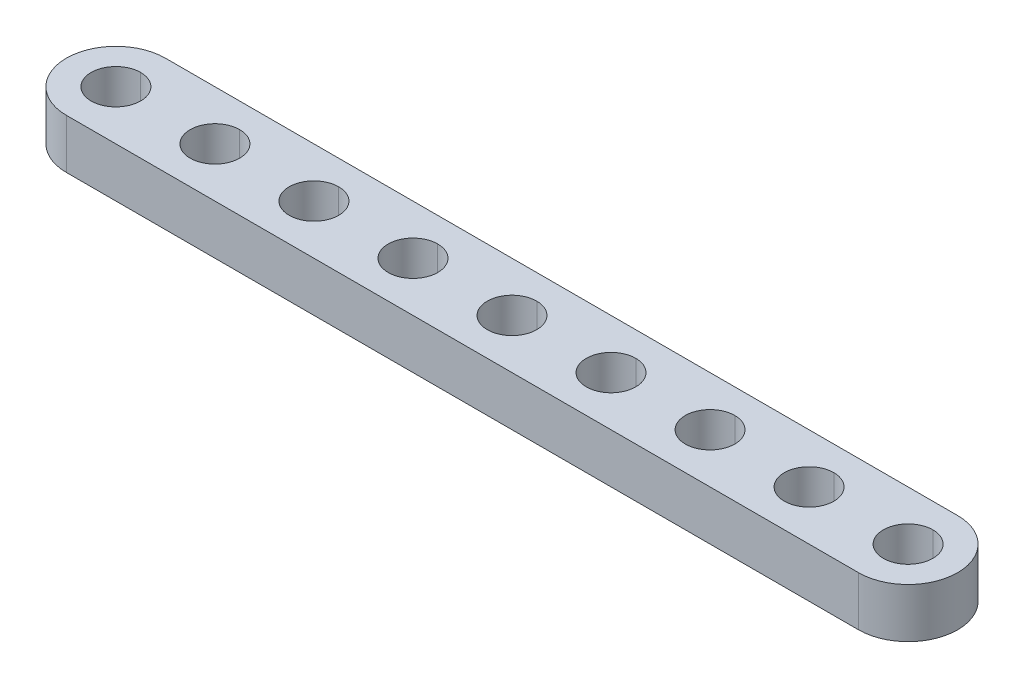
ISO-10303-21;
HEADER;
FILE_DESCRIPTION(('STEP AP214'),'2;1');
FILE_NAME('part.step','',(''),(''),'','','');
FILE_SCHEMA(('AUTOMOTIVE_DESIGN { 1 0 10303 214 1 1 1 1 }'));
ENDSEC;
DATA;
#1=APPLICATION_CONTEXT('core data for automotive mechanical design processes');
#2=APPLICATION_PROTOCOL_DEFINITION('international standard','automotive_design',2000,#1);
#3=PRODUCT_CONTEXT('',#1,'mechanical');
#4=PRODUCT('Part','Part','',(#3));
#5=PRODUCT_RELATED_PRODUCT_CATEGORY('part','',(#4));
#6=PRODUCT_DEFINITION_FORMATION('','',#4);
#7=PRODUCT_DEFINITION_CONTEXT('part definition',#1,'design');
#8=PRODUCT_DEFINITION('design','',#6,#7);
#9=PRODUCT_DEFINITION_SHAPE('','',#8);
#10=(LENGTH_UNIT() NAMED_UNIT(*) SI_UNIT(.MILLI.,.METRE.));
#11=(NAMED_UNIT(*) PLANE_ANGLE_UNIT() SI_UNIT($,.RADIAN.));
#12=(NAMED_UNIT(*) SI_UNIT($,.STERADIAN.) SOLID_ANGLE_UNIT());
#13=UNCERTAINTY_MEASURE_WITH_UNIT(LENGTH_MEASURE(1.E-05),#10,'distance_accuracy_value','');
#14=(GEOMETRIC_REPRESENTATION_CONTEXT(3) GLOBAL_UNCERTAINTY_ASSIGNED_CONTEXT((#13)) GLOBAL_UNIT_ASSIGNED_CONTEXT((#10,
#11,#12)) REPRESENTATION_CONTEXT('',''));
#15=CARTESIAN_POINT('',(0.,0.,0.));
#16=DIRECTION('',(0.,0.,1.));
#17=DIRECTION('',(1.,0.,0.));
#18=AXIS2_PLACEMENT_3D('',#15,#16,#17);
#19=CARTESIAN_POINT('',(32.,4.,0.));
#20=DIRECTION('',(0.,1.,0.));
#21=DIRECTION('',(0.,0.,1.));
#22=AXIS2_PLACEMENT_3D('',#19,#20,#21);
#23=CYLINDRICAL_SURFACE('',#22,2.);
#24=DIRECTION('',(0.,1.,0.));
#25=VECTOR('',#24,1.);
#26=CARTESIAN_POINT('',(32.,4.,-2.));
#27=LINE('',#26,#25);
#28=CARTESIAN_POINT('',(32.,0.,-2.));
#29=VERTEX_POINT('',#28);
#30=CARTESIAN_POINT('',(32.,4.,-2.));
#31=VERTEX_POINT('',#30);
#32=EDGE_CURVE('E353',#29,#31,#27,.T.);
#33=ORIENTED_EDGE('',*,*,#32,.F.);
#34=CARTESIAN_POINT('',(32.,0.,0.));
#35=DIRECTION('',(0.,1.,0.));
#36=DIRECTION('',(0.,0.,1.));
#37=AXIS2_PLACEMENT_3D('',#34,#35,#36);
#38=CIRCLE('',#37,2.);
#39=CARTESIAN_POINT('',(32.,0.,2.));
#40=VERTEX_POINT('',#39);
#41=EDGE_CURVE('E298',#40,#29,#38,.T.);
#42=ORIENTED_EDGE('',*,*,#41,.F.);
#43=DIRECTION('',(0.,1.,0.));
#44=VECTOR('',#43,1.);
#45=CARTESIAN_POINT('',(32.,4.,2.));
#46=LINE('',#45,#44);
#47=CARTESIAN_POINT('',(32.,4.,2.));
#48=VERTEX_POINT('',#47);
#49=EDGE_CURVE('E406',#40,#48,#46,.T.);
#50=ORIENTED_EDGE('',*,*,#49,.T.);
#51=CARTESIAN_POINT('',(32.,4.,0.));
#52=DIRECTION('',(0.,1.,0.));
#53=DIRECTION('',(0.,0.,1.));
#54=AXIS2_PLACEMENT_3D('',#51,#52,#53);
#55=CIRCLE('',#54,2.);
#56=EDGE_CURVE('E276',#48,#31,#55,.T.);
#57=ORIENTED_EDGE('',*,*,#56,.T.);
#58=EDGE_LOOP('',(#33,#42,#50,#57));
#59=FACE_BOUND('',#58,.T.);
#60=ADVANCED_FACE('F17',(#59),#23,.F.);
#61=CARTESIAN_POINT('',(24.,4.,0.));
#62=DIRECTION('',(0.,1.,0.));
#63=DIRECTION('',(0.,0.,1.));
#64=AXIS2_PLACEMENT_3D('',#61,#62,#63);
#65=CYLINDRICAL_SURFACE('',#64,2.);
#66=DIRECTION('',(0.,1.,0.));
#67=VECTOR('',#66,1.);
#68=CARTESIAN_POINT('',(24.,4.,-2.));
#69=LINE('',#68,#67);
#70=CARTESIAN_POINT('',(24.,0.,-2.));
#71=VERTEX_POINT('',#70);
#72=CARTESIAN_POINT('',(24.,4.,-2.));
#73=VERTEX_POINT('',#72);
#74=EDGE_CURVE('E503',#71,#73,#69,.T.);
#75=ORIENTED_EDGE('',*,*,#74,.F.);
#76=CARTESIAN_POINT('',(24.,0.,0.));
#77=DIRECTION('',(0.,1.,0.));
#78=DIRECTION('',(0.,0.,1.));
#79=AXIS2_PLACEMENT_3D('',#76,#77,#78);
#80=CIRCLE('',#79,2.);
#81=CARTESIAN_POINT('',(24.,0.,2.));
#82=VERTEX_POINT('',#81);
#83=EDGE_CURVE('E301',#82,#71,#80,.T.);
#84=ORIENTED_EDGE('',*,*,#83,.F.);
#85=DIRECTION('',(0.,1.,0.));
#86=VECTOR('',#85,1.);
#87=CARTESIAN_POINT('',(24.,4.,2.));
#88=LINE('',#87,#86);
#89=CARTESIAN_POINT('',(24.,4.,2.));
#90=VERTEX_POINT('',#89);
#91=EDGE_CURVE('E359',#82,#90,#88,.T.);
#92=ORIENTED_EDGE('',*,*,#91,.T.);
#93=CARTESIAN_POINT('',(24.,4.,0.));
#94=DIRECTION('',(0.,1.,0.));
#95=DIRECTION('',(0.,0.,1.));
#96=AXIS2_PLACEMENT_3D('',#93,#94,#95);
#97=CIRCLE('',#96,2.);
#98=EDGE_CURVE('E272',#90,#73,#97,.T.);
#99=ORIENTED_EDGE('',*,*,#98,.T.);
#100=EDGE_LOOP('',(#75,#84,#92,#99));
#101=FACE_BOUND('',#100,.T.);
#102=ADVANCED_FACE('F431',(#101),#65,.F.);
#103=CARTESIAN_POINT('',(16.,4.,0.));
#104=DIRECTION('',(0.,1.,0.));
#105=DIRECTION('',(0.,0.,1.));
#106=AXIS2_PLACEMENT_3D('',#103,#104,#105);
#107=CYLINDRICAL_SURFACE('',#106,2.);
#108=DIRECTION('',(0.,1.,0.));
#109=VECTOR('',#108,1.);
#110=CARTESIAN_POINT('',(16.,4.,-2.));
#111=LINE('',#110,#109);
#112=CARTESIAN_POINT('',(16.,0.,-2.));
#113=VERTEX_POINT('',#112);
#114=CARTESIAN_POINT('',(16.,4.,-2.));
#115=VERTEX_POINT('',#114);
#116=EDGE_CURVE('E372',#113,#115,#111,.T.);
#117=ORIENTED_EDGE('',*,*,#116,.F.);
#118=CARTESIAN_POINT('',(16.,0.,0.));
#119=DIRECTION('',(0.,1.,0.));
#120=DIRECTION('',(0.,0.,1.));
#121=AXIS2_PLACEMENT_3D('',#118,#119,#120);
#122=CIRCLE('',#121,2.);
#123=CARTESIAN_POINT('',(16.,0.,2.));
#124=VERTEX_POINT('',#123);
#125=EDGE_CURVE('E312',#124,#113,#122,.T.);
#126=ORIENTED_EDGE('',*,*,#125,.F.);
#127=DIRECTION('',(0.,1.,0.));
#128=VECTOR('',#127,1.);
#129=CARTESIAN_POINT('',(16.,4.,2.));
#130=LINE('',#129,#128);
#131=CARTESIAN_POINT('',(16.,4.,2.));
#132=VERTEX_POINT('',#131);
#133=EDGE_CURVE('E334',#124,#132,#130,.T.);
#134=ORIENTED_EDGE('',*,*,#133,.T.);
#135=CARTESIAN_POINT('',(16.,4.,0.));
#136=DIRECTION('',(0.,1.,0.));
#137=DIRECTION('',(0.,0.,1.));
#138=AXIS2_PLACEMENT_3D('',#135,#136,#137);
#139=CIRCLE('',#138,2.);
#140=EDGE_CURVE('E275',#132,#115,#139,.T.);
#141=ORIENTED_EDGE('',*,*,#140,.T.);
#142=EDGE_LOOP('',(#117,#126,#134,#141));
#143=FACE_BOUND('',#142,.T.);
#144=ADVANCED_FACE('F437',(#143),#107,.F.);
#145=CARTESIAN_POINT('',(8.,4.,0.));
#146=DIRECTION('',(0.,1.,0.));
#147=DIRECTION('',(0.,0.,1.));
#148=AXIS2_PLACEMENT_3D('',#145,#146,#147);
#149=CYLINDRICAL_SURFACE('',#148,2.);
#150=DIRECTION('',(0.,1.,0.));
#151=VECTOR('',#150,1.);
#152=CARTESIAN_POINT('',(8.,4.,-2.));
#153=LINE('',#152,#151);
#154=CARTESIAN_POINT('',(8.,0.,-2.));
#155=VERTEX_POINT('',#154);
#156=CARTESIAN_POINT('',(8.,4.,-2.));
#157=VERTEX_POINT('',#156);
#158=EDGE_CURVE('E319',#155,#157,#153,.T.);
#159=ORIENTED_EDGE('',*,*,#158,.F.);
#160=CARTESIAN_POINT('',(8.,0.,0.));
#161=DIRECTION('',(0.,1.,0.));
#162=DIRECTION('',(0.,0.,1.));
#163=AXIS2_PLACEMENT_3D('',#160,#161,#162);
#164=CIRCLE('',#163,2.);
#165=CARTESIAN_POINT('',(8.,0.,2.));
#166=VERTEX_POINT('',#165);
#167=EDGE_CURVE('E227',#166,#155,#164,.T.);
#168=ORIENTED_EDGE('',*,*,#167,.F.);
#169=DIRECTION('',(0.,1.,0.));
#170=VECTOR('',#169,1.);
#171=CARTESIAN_POINT('',(8.,4.,2.));
#172=LINE('',#171,#170);
#173=CARTESIAN_POINT('',(8.,4.,2.));
#174=VERTEX_POINT('',#173);
#175=EDGE_CURVE('E242',#166,#174,#172,.T.);
#176=ORIENTED_EDGE('',*,*,#175,.T.);
#177=CARTESIAN_POINT('',(8.,4.,0.));
#178=DIRECTION('',(0.,1.,0.));
#179=DIRECTION('',(0.,0.,1.));
#180=AXIS2_PLACEMENT_3D('',#177,#178,#179);
#181=CIRCLE('',#180,2.);
#182=EDGE_CURVE('E286',#174,#157,#181,.T.);
#183=ORIENTED_EDGE('',*,*,#182,.T.);
#184=EDGE_LOOP('',(#159,#168,#176,#183));
#185=FACE_BOUND('',#184,.T.);
#186=ADVANCED_FACE('F576',(#185),#149,.F.);
#187=CARTESIAN_POINT('',(0.,4.,0.));
#188=DIRECTION('',(0.,1.,0.));
#189=DIRECTION('',(0.,0.,1.));
#190=AXIS2_PLACEMENT_3D('',#187,#188,#189);
#191=CYLINDRICAL_SURFACE('',#190,2.);
#192=DIRECTION('',(0.,1.,0.));
#193=VECTOR('',#192,1.);
#194=CARTESIAN_POINT('',(0.,4.,-2.));
#195=LINE('',#194,#193);
#196=CARTESIAN_POINT('',(0.,0.,-2.));
#197=VERTEX_POINT('',#196);
#198=CARTESIAN_POINT('',(0.,4.,-2.));
#199=VERTEX_POINT('',#198);
#200=EDGE_CURVE('E230',#197,#199,#195,.T.);
#201=ORIENTED_EDGE('',*,*,#200,.F.);
#202=CARTESIAN_POINT('',(0.,0.,0.));
#203=DIRECTION('',(0.,1.,0.));
#204=DIRECTION('',(0.,0.,1.));
#205=AXIS2_PLACEMENT_3D('',#202,#203,#204);
#206=CIRCLE('',#205,2.);
#207=CARTESIAN_POINT('',(0.,0.,2.));
#208=VERTEX_POINT('',#207);
#209=EDGE_CURVE('E216',#208,#197,#206,.T.);
#210=ORIENTED_EDGE('',*,*,#209,.F.);
#211=DIRECTION('',(0.,1.,0.));
#212=VECTOR('',#211,1.);
#213=CARTESIAN_POINT('',(0.,4.,2.));
#214=LINE('',#213,#212);
#215=CARTESIAN_POINT('',(0.,4.,2.));
#216=VERTEX_POINT('',#215);
#217=EDGE_CURVE('E240',#208,#216,#214,.T.);
#218=ORIENTED_EDGE('',*,*,#217,.T.);
#219=CARTESIAN_POINT('',(0.,4.,0.));
#220=DIRECTION('',(0.,1.,0.));
#221=DIRECTION('',(0.,0.,1.));
#222=AXIS2_PLACEMENT_3D('',#219,#220,#221);
#223=CIRCLE('',#222,2.);
#224=EDGE_CURVE('E232',#216,#199,#223,.T.);
#225=ORIENTED_EDGE('',*,*,#224,.T.);
#226=EDGE_LOOP('',(#201,#210,#218,#225));
#227=FACE_BOUND('',#226,.T.);
#228=ADVANCED_FACE('F231',(#227),#191,.F.);
#229=CARTESIAN_POINT('',(-8.,4.,0.));
#230=DIRECTION('',(0.,1.,0.));
#231=DIRECTION('',(0.,0.,1.));
#232=AXIS2_PLACEMENT_3D('',#229,#230,#231);
#233=CYLINDRICAL_SURFACE('',#232,2.);
#234=DIRECTION('',(0.,1.,0.));
#235=VECTOR('',#234,1.);
#236=CARTESIAN_POINT('',(-8.,4.,-2.));
#237=LINE('',#236,#235);
#238=CARTESIAN_POINT('',(-8.,0.,-2.));
#239=VERTEX_POINT('',#238);
#240=CARTESIAN_POINT('',(-8.,4.,-2.));
#241=VERTEX_POINT('',#240);
#242=EDGE_CURVE('E287',#239,#241,#237,.T.);
#243=ORIENTED_EDGE('',*,*,#242,.F.);
#244=CARTESIAN_POINT('',(-8.,0.,0.));
#245=DIRECTION('',(0.,1.,0.));
#246=DIRECTION('',(0.,0.,1.));
#247=AXIS2_PLACEMENT_3D('',#244,#245,#246);
#248=CIRCLE('',#247,2.);
#249=CARTESIAN_POINT('',(-8.,0.,2.));
#250=VERTEX_POINT('',#249);
#251=EDGE_CURVE('E226',#250,#239,#248,.T.);
#252=ORIENTED_EDGE('',*,*,#251,.F.);
#253=DIRECTION('',(0.,1.,0.));
#254=VECTOR('',#253,1.);
#255=CARTESIAN_POINT('',(-8.,4.,2.));
#256=LINE('',#255,#254);
#257=CARTESIAN_POINT('',(-8.,4.,2.));
#258=VERTEX_POINT('',#257);
#259=EDGE_CURVE('E311',#250,#258,#256,.T.);
#260=ORIENTED_EDGE('',*,*,#259,.T.);
#261=CARTESIAN_POINT('',(-8.,4.,0.));
#262=DIRECTION('',(0.,1.,0.));
#263=DIRECTION('',(0.,0.,1.));
#264=AXIS2_PLACEMENT_3D('',#261,#262,#263);
#265=CIRCLE('',#264,2.);
#266=EDGE_CURVE('E305',#258,#241,#265,.T.);
#267=ORIENTED_EDGE('',*,*,#266,.T.);
#268=EDGE_LOOP('',(#243,#252,#260,#267));
#269=FACE_BOUND('',#268,.T.);
#270=ADVANCED_FACE('F581',(#269),#233,.F.);
#271=CARTESIAN_POINT('',(-16.,4.,0.));
#272=DIRECTION('',(0.,1.,0.));
#273=DIRECTION('',(0.,0.,1.));
#274=AXIS2_PLACEMENT_3D('',#271,#272,#273);
#275=CYLINDRICAL_SURFACE('',#274,2.);
#276=DIRECTION('',(0.,1.,0.));
#277=VECTOR('',#276,1.);
#278=CARTESIAN_POINT('',(-16.,4.,-2.));
#279=LINE('',#278,#277);
#280=CARTESIAN_POINT('',(-16.,0.,-2.));
#281=VERTEX_POINT('',#280);
#282=CARTESIAN_POINT('',(-16.,4.,-2.));
#283=VERTEX_POINT('',#282);
#284=EDGE_CURVE('E310',#281,#283,#279,.T.);
#285=ORIENTED_EDGE('',*,*,#284,.F.);
#286=CARTESIAN_POINT('',(-16.,0.,0.));
#287=DIRECTION('',(0.,1.,0.));
#288=DIRECTION('',(0.,0.,1.));
#289=AXIS2_PLACEMENT_3D('',#286,#287,#288);
#290=CIRCLE('',#289,2.);
#291=CARTESIAN_POINT('',(-16.,0.,2.));
#292=VERTEX_POINT('',#291);
#293=EDGE_CURVE('E381',#292,#281,#290,.T.);
#294=ORIENTED_EDGE('',*,*,#293,.F.);
#295=DIRECTION('',(0.,1.,0.));
#296=VECTOR('',#295,1.);
#297=CARTESIAN_POINT('',(-16.,4.,2.));
#298=LINE('',#297,#296);
#299=CARTESIAN_POINT('',(-16.,4.,2.));
#300=VERTEX_POINT('',#299);
#301=EDGE_CURVE('E282',#292,#300,#298,.T.);
#302=ORIENTED_EDGE('',*,*,#301,.T.);
#303=CARTESIAN_POINT('',(-16.,4.,0.));
#304=DIRECTION('',(0.,1.,0.));
#305=DIRECTION('',(0.,0.,1.));
#306=AXIS2_PLACEMENT_3D('',#303,#304,#305);
#307=CIRCLE('',#306,2.);
#308=EDGE_CURVE('E330',#300,#283,#307,.T.);
#309=ORIENTED_EDGE('',*,*,#308,.T.);
#310=EDGE_LOOP('',(#285,#294,#302,#309));
#311=FACE_BOUND('',#310,.T.);
#312=ADVANCED_FACE('F446',(#311),#275,.F.);
#313=CARTESIAN_POINT('',(-24.,4.,0.));
#314=DIRECTION('',(0.,1.,0.));
#315=DIRECTION('',(0.,0.,1.));
#316=AXIS2_PLACEMENT_3D('',#313,#314,#315);
#317=CYLINDRICAL_SURFACE('',#316,2.);
#318=DIRECTION('',(0.,1.,0.));
#319=VECTOR('',#318,1.);
#320=CARTESIAN_POINT('',(-24.,4.,-2.));
#321=LINE('',#320,#319);
#322=CARTESIAN_POINT('',(-24.,0.,-2.));
#323=VERTEX_POINT('',#322);
#324=CARTESIAN_POINT('',(-24.,4.,-2.));
#325=VERTEX_POINT('',#324);
#326=EDGE_CURVE('E281',#323,#325,#321,.T.);
#327=ORIENTED_EDGE('',*,*,#326,.F.);
#328=CARTESIAN_POINT('',(-24.,0.,0.));
#329=DIRECTION('',(0.,1.,0.));
#330=DIRECTION('',(0.,0.,1.));
#331=AXIS2_PLACEMENT_3D('',#328,#329,#330);
#332=CIRCLE('',#331,2.);
#333=CARTESIAN_POINT('',(-24.,0.,2.));
#334=VERTEX_POINT('',#333);
#335=EDGE_CURVE('E28',#334,#323,#332,.T.);
#336=ORIENTED_EDGE('',*,*,#335,.F.);
#337=DIRECTION('',(0.,1.,0.));
#338=VECTOR('',#337,1.);
#339=CARTESIAN_POINT('',(-24.,4.,2.));
#340=LINE('',#339,#338);
#341=CARTESIAN_POINT('',(-24.,4.,2.));
#342=VERTEX_POINT('',#341);
#343=EDGE_CURVE('E352',#334,#342,#340,.T.);
#344=ORIENTED_EDGE('',*,*,#343,.T.);
#345=CARTESIAN_POINT('',(-24.,4.,0.));
#346=DIRECTION('',(0.,1.,0.));
#347=DIRECTION('',(0.,0.,1.));
#348=AXIS2_PLACEMENT_3D('',#345,#346,#347);
#349=CIRCLE('',#348,2.);
#350=EDGE_CURVE('E327',#342,#325,#349,.T.);
#351=ORIENTED_EDGE('',*,*,#350,.T.);
#352=EDGE_LOOP('',(#327,#336,#344,#351));
#353=FACE_BOUND('',#352,.T.);
#354=ADVANCED_FACE('F443',(#353),#317,.F.);
#355=CARTESIAN_POINT('',(-32.,4.,0.));
#356=DIRECTION('',(0.,1.,0.));
#357=DIRECTION('',(0.,0.,1.));
#358=AXIS2_PLACEMENT_3D('',#355,#356,#357);
#359=CYLINDRICAL_SURFACE('',#358,2.);
#360=DIRECTION('',(0.,1.,0.));
#361=VECTOR('',#360,1.);
#362=CARTESIAN_POINT('',(-32.,4.,-2.));
#363=LINE('',#362,#361);
#364=CARTESIAN_POINT('',(-32.,0.,-2.));
#365=VERTEX_POINT('',#364);
#366=CARTESIAN_POINT('',(-32.,4.,-2.));
#367=VERTEX_POINT('',#366);
#368=EDGE_CURVE('E271',#365,#367,#363,.T.);
#369=ORIENTED_EDGE('',*,*,#368,.F.);
#370=CARTESIAN_POINT('',(-32.,0.,0.));
#371=DIRECTION('',(0.,1.,0.));
#372=DIRECTION('',(0.,0.,1.));
#373=AXIS2_PLACEMENT_3D('',#370,#371,#372);
#374=CIRCLE('',#373,2.);
#375=CARTESIAN_POINT('',(-32.,0.,2.));
#376=VERTEX_POINT('',#375);
#377=EDGE_CURVE('E11',#376,#365,#374,.T.);
#378=ORIENTED_EDGE('',*,*,#377,.F.);
#379=DIRECTION('',(0.,1.,0.));
#380=VECTOR('',#379,1.);
#381=CARTESIAN_POINT('',(-32.,4.,2.));
#382=LINE('',#381,#380);
#383=CARTESIAN_POINT('',(-32.,4.,2.));
#384=VERTEX_POINT('',#383);
#385=EDGE_CURVE('E21',#376,#384,#382,.T.);
#386=ORIENTED_EDGE('',*,*,#385,.T.);
#387=CARTESIAN_POINT('',(-32.,4.,0.));
#388=DIRECTION('',(0.,1.,0.));
#389=DIRECTION('',(0.,0.,1.));
#390=AXIS2_PLACEMENT_3D('',#387,#388,#389);
#391=CIRCLE('',#390,2.);
#392=EDGE_CURVE('E302',#384,#367,#391,.T.);
#393=ORIENTED_EDGE('',*,*,#392,.T.);
#394=EDGE_LOOP('',(#369,#378,#386,#393));
#395=FACE_BOUND('',#394,.T.);
#396=ADVANCED_FACE('F19',(#395),#359,.F.);
#397=CARTESIAN_POINT('',(-32.,0.,0.));
#398=DIRECTION('',(0.,1.,0.));
#399=DIRECTION('',(1.,0.,0.));
#400=AXIS2_PLACEMENT_3D('',#397,#398,#399);
#401=PLANE('',#400);
#402=ORIENTED_EDGE('',*,*,#377,.T.);
#403=CARTESIAN_POINT('',(-32.,0.,0.));
#404=DIRECTION('',(0.,1.,0.));
#405=DIRECTION('',(0.,0.,1.));
#406=AXIS2_PLACEMENT_3D('',#403,#404,#405);
#407=CIRCLE('',#406,2.);
#408=EDGE_CURVE('E348',#365,#376,#407,.T.);
#409=ORIENTED_EDGE('',*,*,#408,.T.);
#410=EDGE_LOOP('',(#402,#409));
#411=FACE_BOUND('',#410,.T.);
#412=ORIENTED_EDGE('',*,*,#335,.T.);
#413=CARTESIAN_POINT('',(-24.,0.,0.));
#414=DIRECTION('',(0.,1.,0.));
#415=DIRECTION('',(0.,0.,1.));
#416=AXIS2_PLACEMENT_3D('',#413,#414,#415);
#417=CIRCLE('',#416,2.);
#418=EDGE_CURVE('E277',#323,#334,#417,.T.);
#419=ORIENTED_EDGE('',*,*,#418,.T.);
#420=EDGE_LOOP('',(#412,#419));
#421=FACE_BOUND('',#420,.T.);
#422=ORIENTED_EDGE('',*,*,#293,.T.);
#423=CARTESIAN_POINT('',(-16.,0.,0.));
#424=DIRECTION('',(0.,1.,0.));
#425=DIRECTION('',(0.,0.,1.));
#426=AXIS2_PLACEMENT_3D('',#423,#424,#425);
#427=CIRCLE('',#426,2.);
#428=EDGE_CURVE('E306',#281,#292,#427,.T.);
#429=ORIENTED_EDGE('',*,*,#428,.T.);
#430=EDGE_LOOP('',(#422,#429));
#431=FACE_BOUND('',#430,.T.);
#432=ORIENTED_EDGE('',*,*,#251,.T.);
#433=CARTESIAN_POINT('',(-8.,0.,0.));
#434=DIRECTION('',(0.,1.,0.));
#435=DIRECTION('',(0.,0.,1.));
#436=AXIS2_PLACEMENT_3D('',#433,#434,#435);
#437=CIRCLE('',#436,2.);
#438=EDGE_CURVE('E292',#239,#250,#437,.T.);
#439=ORIENTED_EDGE('',*,*,#438,.T.);
#440=EDGE_LOOP('',(#432,#439));
#441=FACE_BOUND('',#440,.T.);
#442=ORIENTED_EDGE('',*,*,#209,.T.);
#443=CARTESIAN_POINT('',(0.,0.,0.));
#444=DIRECTION('',(0.,1.,0.));
#445=DIRECTION('',(0.,0.,1.));
#446=AXIS2_PLACEMENT_3D('',#443,#444,#445);
#447=CIRCLE('',#446,2.);
#448=EDGE_CURVE('E221',#197,#208,#447,.T.);
#449=ORIENTED_EDGE('',*,*,#448,.T.);
#450=EDGE_LOOP('',(#442,#449));
#451=FACE_BOUND('',#450,.T.);
#452=ORIENTED_EDGE('',*,*,#167,.T.);
#453=CARTESIAN_POINT('',(8.,0.,0.));
#454=DIRECTION('',(0.,1.,0.));
#455=DIRECTION('',(0.,0.,1.));
#456=AXIS2_PLACEMENT_3D('',#453,#454,#455);
#457=CIRCLE('',#456,2.);
#458=EDGE_CURVE('E323',#155,#166,#457,.T.);
#459=ORIENTED_EDGE('',*,*,#458,.T.);
#460=EDGE_LOOP('',(#452,#459));
#461=FACE_BOUND('',#460,.T.);
#462=ORIENTED_EDGE('',*,*,#125,.T.);
#463=CARTESIAN_POINT('',(16.,0.,0.));
#464=DIRECTION('',(0.,1.,0.));
#465=DIRECTION('',(0.,0.,1.));
#466=AXIS2_PLACEMENT_3D('',#463,#464,#465);
#467=CIRCLE('',#466,2.);
#468=EDGE_CURVE('E363',#113,#124,#467,.T.);
#469=ORIENTED_EDGE('',*,*,#468,.T.);
#470=EDGE_LOOP('',(#462,#469));
#471=FACE_BOUND('',#470,.T.);
#472=ORIENTED_EDGE('',*,*,#83,.T.);
#473=CARTESIAN_POINT('',(24.,0.,0.));
#474=DIRECTION('',(0.,1.,0.));
#475=DIRECTION('',(0.,0.,1.));
#476=AXIS2_PLACEMENT_3D('',#473,#474,#475);
#477=CIRCLE('',#476,2.);
#478=EDGE_CURVE('E505',#71,#82,#477,.T.);
#479=ORIENTED_EDGE('',*,*,#478,.T.);
#480=EDGE_LOOP('',(#472,#479));
#481=FACE_BOUND('',#480,.T.);
#482=ORIENTED_EDGE('',*,*,#41,.T.);
#483=CARTESIAN_POINT('',(32.,0.,0.));
#484=DIRECTION('',(0.,1.,0.));
#485=DIRECTION('',(0.,0.,1.));
#486=AXIS2_PLACEMENT_3D('',#483,#484,#485);
#487=CIRCLE('',#486,2.);
#488=EDGE_CURVE('E358',#29,#40,#487,.T.);
#489=ORIENTED_EDGE('',*,*,#488,.T.);
#490=EDGE_LOOP('',(#482,#489));
#491=FACE_BOUND('',#490,.T.);
#492=CARTESIAN_POINT('',(-32.,0.,0.));
#493=DIRECTION('',(0.,1.,0.));
#494=DIRECTION('',(0.,0.,1.));
#495=AXIS2_PLACEMENT_3D('',#492,#493,#494);
#496=CIRCLE('',#495,4.);
#497=CARTESIAN_POINT('',(-32.,0.,-4.));
#498=VERTEX_POINT('',#497);
#499=CARTESIAN_POINT('',(-32.,0.,4.));
#500=VERTEX_POINT('',#499);
#501=EDGE_CURVE('E368',#498,#500,#496,.T.);
#502=ORIENTED_EDGE('',*,*,#501,.F.);
#503=DIRECTION('',(-1.,0.,0.));
#504=VECTOR('',#503,1.);
#505=CARTESIAN_POINT('',(-32.,0.,-4.));
#506=LINE('',#505,#504);
#507=CARTESIAN_POINT('',(32.,0.,-4.));
#508=VERTEX_POINT('',#507);
#509=EDGE_CURVE('E147',#508,#498,#506,.T.);
#510=ORIENTED_EDGE('',*,*,#509,.F.);
#511=CARTESIAN_POINT('',(32.,0.,0.));
#512=DIRECTION('',(0.,1.,0.));
#513=DIRECTION('',(0.,0.,1.));
#514=AXIS2_PLACEMENT_3D('',#511,#512,#513);
#515=CIRCLE('',#514,4.);
#516=CARTESIAN_POINT('',(32.,0.,4.));
#517=VERTEX_POINT('',#516);
#518=EDGE_CURVE('E261',#517,#508,#515,.T.);
#519=ORIENTED_EDGE('',*,*,#518,.F.);
#520=DIRECTION('',(1.,0.,0.));
#521=VECTOR('',#520,1.);
#522=CARTESIAN_POINT('',(-32.,0.,4.));
#523=LINE('',#522,#521);
#524=EDGE_CURVE('E159',#500,#517,#523,.T.);
#525=ORIENTED_EDGE('',*,*,#524,.F.);
#526=EDGE_LOOP('',(#502,#510,#519,#525));
#527=FACE_BOUND('',#526,.T.);
#528=ADVANCED_FACE('F218',(#411,#421,#431,#441,#451,#461,#471,#481,#491,#527),#401,.F.);
#529=CARTESIAN_POINT('',(-32.,4.,0.));
#530=DIRECTION('',(0.,1.,0.));
#531=DIRECTION('',(1.,0.,0.));
#532=AXIS2_PLACEMENT_3D('',#529,#530,#531);
#533=PLANE('',#532);
#534=ORIENTED_EDGE('',*,*,#392,.F.);
#535=CARTESIAN_POINT('',(-32.,4.,0.));
#536=DIRECTION('',(0.,1.,0.));
#537=DIRECTION('',(0.,0.,1.));
#538=AXIS2_PLACEMENT_3D('',#535,#536,#537);
#539=CIRCLE('',#538,2.);
#540=EDGE_CURVE('E267',#367,#384,#539,.T.);
#541=ORIENTED_EDGE('',*,*,#540,.F.);
#542=EDGE_LOOP('',(#534,#541));
#543=FACE_BOUND('',#542,.T.);
#544=ORIENTED_EDGE('',*,*,#350,.F.);
#545=CARTESIAN_POINT('',(-24.,4.,0.));
#546=DIRECTION('',(0.,1.,0.));
#547=DIRECTION('',(0.,0.,1.));
#548=AXIS2_PLACEMENT_3D('',#545,#546,#547);
#549=CIRCLE('',#548,2.);
#550=EDGE_CURVE('E482',#325,#342,#549,.T.);
#551=ORIENTED_EDGE('',*,*,#550,.F.);
#552=EDGE_LOOP('',(#544,#551));
#553=FACE_BOUND('',#552,.T.);
#554=ORIENTED_EDGE('',*,*,#308,.F.);
#555=CARTESIAN_POINT('',(-16.,4.,0.));
#556=DIRECTION('',(0.,1.,0.));
#557=DIRECTION('',(0.,0.,1.));
#558=AXIS2_PLACEMENT_3D('',#555,#556,#557);
#559=CIRCLE('',#558,2.);
#560=EDGE_CURVE('E367',#283,#300,#559,.T.);
#561=ORIENTED_EDGE('',*,*,#560,.F.);
#562=EDGE_LOOP('',(#554,#561));
#563=FACE_BOUND('',#562,.T.);
#564=ORIENTED_EDGE('',*,*,#266,.F.);
#565=CARTESIAN_POINT('',(-8.,4.,0.));
#566=DIRECTION('',(0.,1.,0.));
#567=DIRECTION('',(0.,0.,1.));
#568=AXIS2_PLACEMENT_3D('',#565,#566,#567);
#569=CIRCLE('',#568,2.);
#570=EDGE_CURVE('E291',#241,#258,#569,.T.);
#571=ORIENTED_EDGE('',*,*,#570,.F.);
#572=EDGE_LOOP('',(#564,#571));
#573=FACE_BOUND('',#572,.T.);
#574=ORIENTED_EDGE('',*,*,#224,.F.);
#575=CARTESIAN_POINT('',(0.,4.,0.));
#576=DIRECTION('',(0.,1.,0.));
#577=DIRECTION('',(0.,0.,1.));
#578=AXIS2_PLACEMENT_3D('',#575,#576,#577);
#579=CIRCLE('',#578,2.);
#580=EDGE_CURVE('E237',#199,#216,#579,.T.);
#581=ORIENTED_EDGE('',*,*,#580,.F.);
#582=EDGE_LOOP('',(#574,#581));
#583=FACE_BOUND('',#582,.T.);
#584=ORIENTED_EDGE('',*,*,#182,.F.);
#585=CARTESIAN_POINT('',(8.,4.,0.));
#586=DIRECTION('',(0.,1.,0.));
#587=DIRECTION('',(0.,0.,1.));
#588=AXIS2_PLACEMENT_3D('',#585,#586,#587);
#589=CIRCLE('',#588,2.);
#590=EDGE_CURVE('E249',#157,#174,#589,.T.);
#591=ORIENTED_EDGE('',*,*,#590,.F.);
#592=EDGE_LOOP('',(#584,#591));
#593=FACE_BOUND('',#592,.T.);
#594=ORIENTED_EDGE('',*,*,#140,.F.);
#595=CARTESIAN_POINT('',(16.,4.,0.));
#596=DIRECTION('',(0.,1.,0.));
#597=DIRECTION('',(0.,0.,1.));
#598=AXIS2_PLACEMENT_3D('',#595,#596,#597);
#599=CIRCLE('',#598,2.);
#600=EDGE_CURVE('E376',#115,#132,#599,.T.);
#601=ORIENTED_EDGE('',*,*,#600,.F.);
#602=EDGE_LOOP('',(#594,#601));
#603=FACE_BOUND('',#602,.T.);
#604=ORIENTED_EDGE('',*,*,#98,.F.);
#605=CARTESIAN_POINT('',(24.,4.,0.));
#606=DIRECTION('',(0.,1.,0.));
#607=DIRECTION('',(0.,0.,1.));
#608=AXIS2_PLACEMENT_3D('',#605,#606,#607);
#609=CIRCLE('',#608,2.);
#610=EDGE_CURVE('E252',#73,#90,#609,.T.);
#611=ORIENTED_EDGE('',*,*,#610,.F.);
#612=EDGE_LOOP('',(#604,#611));
#613=FACE_BOUND('',#612,.T.);
#614=ORIENTED_EDGE('',*,*,#56,.F.);
#615=CARTESIAN_POINT('',(32.,4.,0.));
#616=DIRECTION('',(0.,1.,0.));
#617=DIRECTION('',(0.,0.,1.));
#618=AXIS2_PLACEMENT_3D('',#615,#616,#617);
#619=CIRCLE('',#618,2.);
#620=EDGE_CURVE('E357',#31,#48,#619,.T.);
#621=ORIENTED_EDGE('',*,*,#620,.F.);
#622=EDGE_LOOP('',(#614,#621));
#623=FACE_BOUND('',#622,.T.);
#624=CARTESIAN_POINT('',(-32.,4.,0.));
#625=DIRECTION('',(0.,1.,0.));
#626=DIRECTION('',(0.,0.,1.));
#627=AXIS2_PLACEMENT_3D('',#624,#625,#626);
#628=CIRCLE('',#627,4.);
#629=CARTESIAN_POINT('',(-32.,4.,-4.));
#630=VERTEX_POINT('',#629);
#631=CARTESIAN_POINT('',(-32.,4.,4.));
#632=VERTEX_POINT('',#631);
#633=EDGE_CURVE('E255',#630,#632,#628,.T.);
#634=ORIENTED_EDGE('',*,*,#633,.T.);
#635=DIRECTION('',(1.,0.,0.));
#636=VECTOR('',#635,1.);
#637=CARTESIAN_POINT('',(-32.,4.,4.));
#638=LINE('',#637,#636);
#639=CARTESIAN_POINT('',(32.,4.,4.));
#640=VERTEX_POINT('',#639);
#641=EDGE_CURVE('E266',#632,#640,#638,.T.);
#642=ORIENTED_EDGE('',*,*,#641,.T.);
#643=CARTESIAN_POINT('',(32.,4.,0.));
#644=DIRECTION('',(0.,1.,0.));
#645=DIRECTION('',(0.,0.,1.));
#646=AXIS2_PLACEMENT_3D('',#643,#644,#645);
#647=CIRCLE('',#646,4.);
#648=CARTESIAN_POINT('',(32.,4.,-4.));
#649=VERTEX_POINT('',#648);
#650=EDGE_CURVE('E293',#640,#649,#647,.T.);
#651=ORIENTED_EDGE('',*,*,#650,.T.);
#652=DIRECTION('',(-1.,0.,0.));
#653=VECTOR('',#652,1.);
#654=CARTESIAN_POINT('',(-32.,4.,-4.));
#655=LINE('',#654,#653);
#656=EDGE_CURVE('E43',#649,#630,#655,.T.);
#657=ORIENTED_EDGE('',*,*,#656,.T.);
#658=EDGE_LOOP('',(#634,#642,#651,#657));
#659=FACE_BOUND('',#658,.T.);
#660=ADVANCED_FACE('F426',(#543,#553,#563,#573,#583,#593,#603,#613,#623,#659),#533,.T.);
#661=CARTESIAN_POINT('',(-32.,4.,-4.));
#662=DIRECTION('',(0.,0.,1.));
#663=DIRECTION('',(1.,0.,0.));
#664=AXIS2_PLACEMENT_3D('',#661,#662,#663);
#665=PLANE('',#664);
#666=ORIENTED_EDGE('',*,*,#509,.T.);
#667=DIRECTION('',(0.,-1.,0.));
#668=VECTOR('',#667,1.);
#669=CARTESIAN_POINT('',(-32.,4.,-4.));
#670=LINE('',#669,#668);
#671=EDGE_CURVE('E259',#630,#498,#670,.T.);
#672=ORIENTED_EDGE('',*,*,#671,.F.);
#673=ORIENTED_EDGE('',*,*,#656,.F.);
#674=DIRECTION('',(0.,-1.,0.));
#675=VECTOR('',#674,1.);
#676=CARTESIAN_POINT('',(32.,4.,-4.));
#677=LINE('',#676,#675);
#678=EDGE_CURVE('E265',#649,#508,#677,.T.);
#679=ORIENTED_EDGE('',*,*,#678,.T.);
#680=EDGE_LOOP('',(#666,#672,#673,#679));
#681=FACE_BOUND('',#680,.T.);
#682=ADVANCED_FACE('F416',(#681),#665,.F.);
#683=CARTESIAN_POINT('',(32.,4.,0.));
#684=DIRECTION('',(0.,-1.,0.));
#685=DIRECTION('',(0.,0.,-1.));
#686=AXIS2_PLACEMENT_3D('',#683,#684,#685);
#687=CYLINDRICAL_SURFACE('',#686,4.);
#688=ORIENTED_EDGE('',*,*,#518,.T.);
#689=ORIENTED_EDGE('',*,*,#678,.F.);
#690=ORIENTED_EDGE('',*,*,#650,.F.);
#691=DIRECTION('',(0.,-1.,0.));
#692=VECTOR('',#691,1.);
#693=CARTESIAN_POINT('',(32.,4.,4.));
#694=LINE('',#693,#692);
#695=EDGE_CURVE('E318',#640,#517,#694,.T.);
#696=ORIENTED_EDGE('',*,*,#695,.T.);
#697=EDGE_LOOP('',(#688,#689,#690,#696));
#698=FACE_BOUND('',#697,.T.);
#699=ADVANCED_FACE('F417',(#698),#687,.T.);
#700=CARTESIAN_POINT('',(-32.,4.,4.));
#701=DIRECTION('',(0.,0.,-1.));
#702=DIRECTION('',(0.,-1.,0.));
#703=AXIS2_PLACEMENT_3D('',#700,#701,#702);
#704=PLANE('',#703);
#705=ORIENTED_EDGE('',*,*,#524,.T.);
#706=ORIENTED_EDGE('',*,*,#695,.F.);
#707=ORIENTED_EDGE('',*,*,#641,.F.);
#708=DIRECTION('',(0.,-1.,0.));
#709=VECTOR('',#708,1.);
#710=CARTESIAN_POINT('',(-32.,4.,4.));
#711=LINE('',#710,#709);
#712=EDGE_CURVE('E260',#632,#500,#711,.T.);
#713=ORIENTED_EDGE('',*,*,#712,.T.);
#714=EDGE_LOOP('',(#705,#706,#707,#713));
#715=FACE_BOUND('',#714,.T.);
#716=ADVANCED_FACE('F411',(#715),#704,.F.);
#717=CARTESIAN_POINT('',(-32.,4.,0.));
#718=DIRECTION('',(0.,-1.,0.));
#719=DIRECTION('',(0.,0.,-1.));
#720=AXIS2_PLACEMENT_3D('',#717,#718,#719);
#721=CYLINDRICAL_SURFACE('',#720,4.);
#722=ORIENTED_EDGE('',*,*,#501,.T.);
#723=ORIENTED_EDGE('',*,*,#712,.F.);
#724=ORIENTED_EDGE('',*,*,#633,.F.);
#725=ORIENTED_EDGE('',*,*,#671,.T.);
#726=EDGE_LOOP('',(#722,#723,#724,#725));
#727=FACE_BOUND('',#726,.T.);
#728=ADVANCED_FACE('F414',(#727),#721,.T.);
#729=CARTESIAN_POINT('',(-32.,4.,0.));
#730=DIRECTION('',(0.,1.,0.));
#731=DIRECTION('',(0.,0.,1.));
#732=AXIS2_PLACEMENT_3D('',#729,#730,#731);
#733=CYLINDRICAL_SURFACE('',#732,2.);
#734=ORIENTED_EDGE('',*,*,#408,.F.);
#735=ORIENTED_EDGE('',*,*,#368,.T.);
#736=ORIENTED_EDGE('',*,*,#540,.T.);
#737=ORIENTED_EDGE('',*,*,#385,.F.);
#738=EDGE_LOOP('',(#734,#735,#736,#737));
#739=FACE_BOUND('',#738,.T.);
#740=ADVANCED_FACE('F452',(#739),#733,.F.);
#741=CARTESIAN_POINT('',(-24.,4.,0.));
#742=DIRECTION('',(0.,1.,0.));
#743=DIRECTION('',(0.,0.,1.));
#744=AXIS2_PLACEMENT_3D('',#741,#742,#743);
#745=CYLINDRICAL_SURFACE('',#744,2.);
#746=ORIENTED_EDGE('',*,*,#418,.F.);
#747=ORIENTED_EDGE('',*,*,#326,.T.);
#748=ORIENTED_EDGE('',*,*,#550,.T.);
#749=ORIENTED_EDGE('',*,*,#343,.F.);
#750=EDGE_LOOP('',(#746,#747,#748,#749));
#751=FACE_BOUND('',#750,.T.);
#752=ADVANCED_FACE('F448',(#751),#745,.F.);
#753=CARTESIAN_POINT('',(-16.,4.,0.));
#754=DIRECTION('',(0.,1.,0.));
#755=DIRECTION('',(0.,0.,1.));
#756=AXIS2_PLACEMENT_3D('',#753,#754,#755);
#757=CYLINDRICAL_SURFACE('',#756,2.);
#758=ORIENTED_EDGE('',*,*,#428,.F.);
#759=ORIENTED_EDGE('',*,*,#284,.T.);
#760=ORIENTED_EDGE('',*,*,#560,.T.);
#761=ORIENTED_EDGE('',*,*,#301,.F.);
#762=EDGE_LOOP('',(#758,#759,#760,#761));
#763=FACE_BOUND('',#762,.T.);
#764=ADVANCED_FACE('F451',(#763),#757,.F.);
#765=CARTESIAN_POINT('',(-8.,4.,0.));
#766=DIRECTION('',(0.,1.,0.));
#767=DIRECTION('',(0.,0.,1.));
#768=AXIS2_PLACEMENT_3D('',#765,#766,#767);
#769=CYLINDRICAL_SURFACE('',#768,2.);
#770=ORIENTED_EDGE('',*,*,#438,.F.);
#771=ORIENTED_EDGE('',*,*,#242,.T.);
#772=ORIENTED_EDGE('',*,*,#570,.T.);
#773=ORIENTED_EDGE('',*,*,#259,.F.);
#774=EDGE_LOOP('',(#770,#771,#772,#773));
#775=FACE_BOUND('',#774,.T.);
#776=ADVANCED_FACE('F585',(#775),#769,.F.);
#777=CARTESIAN_POINT('',(0.,4.,0.));
#778=DIRECTION('',(0.,1.,0.));
#779=DIRECTION('',(0.,0.,1.));
#780=AXIS2_PLACEMENT_3D('',#777,#778,#779);
#781=CYLINDRICAL_SURFACE('',#780,2.);
#782=ORIENTED_EDGE('',*,*,#448,.F.);
#783=ORIENTED_EDGE('',*,*,#200,.T.);
#784=ORIENTED_EDGE('',*,*,#580,.T.);
#785=ORIENTED_EDGE('',*,*,#217,.F.);
#786=EDGE_LOOP('',(#782,#783,#784,#785));
#787=FACE_BOUND('',#786,.T.);
#788=ADVANCED_FACE('F239',(#787),#781,.F.);
#789=CARTESIAN_POINT('',(8.,4.,0.));
#790=DIRECTION('',(0.,1.,0.));
#791=DIRECTION('',(0.,0.,1.));
#792=AXIS2_PLACEMENT_3D('',#789,#790,#791);
#793=CYLINDRICAL_SURFACE('',#792,2.);
#794=ORIENTED_EDGE('',*,*,#458,.F.);
#795=ORIENTED_EDGE('',*,*,#158,.T.);
#796=ORIENTED_EDGE('',*,*,#590,.T.);
#797=ORIENTED_EDGE('',*,*,#175,.F.);
#798=EDGE_LOOP('',(#794,#795,#796,#797));
#799=FACE_BOUND('',#798,.T.);
#800=ADVANCED_FACE('F454',(#799),#793,.F.);
#801=CARTESIAN_POINT('',(16.,4.,0.));
#802=DIRECTION('',(0.,1.,0.));
#803=DIRECTION('',(0.,0.,1.));
#804=AXIS2_PLACEMENT_3D('',#801,#802,#803);
#805=CYLINDRICAL_SURFACE('',#804,2.);
#806=ORIENTED_EDGE('',*,*,#468,.F.);
#807=ORIENTED_EDGE('',*,*,#116,.T.);
#808=ORIENTED_EDGE('',*,*,#600,.T.);
#809=ORIENTED_EDGE('',*,*,#133,.F.);
#810=EDGE_LOOP('',(#806,#807,#808,#809));
#811=FACE_BOUND('',#810,.T.);
#812=ADVANCED_FACE('F456',(#811),#805,.F.);
#813=CARTESIAN_POINT('',(24.,4.,0.));
#814=DIRECTION('',(0.,1.,0.));
#815=DIRECTION('',(0.,0.,1.));
#816=AXIS2_PLACEMENT_3D('',#813,#814,#815);
#817=CYLINDRICAL_SURFACE('',#816,2.);
#818=ORIENTED_EDGE('',*,*,#478,.F.);
#819=ORIENTED_EDGE('',*,*,#74,.T.);
#820=ORIENTED_EDGE('',*,*,#610,.T.);
#821=ORIENTED_EDGE('',*,*,#91,.F.);
#822=EDGE_LOOP('',(#818,#819,#820,#821));
#823=FACE_BOUND('',#822,.T.);
#824=ADVANCED_FACE('F460',(#823),#817,.F.);
#825=CARTESIAN_POINT('',(32.,4.,0.));
#826=DIRECTION('',(0.,1.,0.));
#827=DIRECTION('',(0.,0.,1.));
#828=AXIS2_PLACEMENT_3D('',#825,#826,#827);
#829=CYLINDRICAL_SURFACE('',#828,2.);
#830=ORIENTED_EDGE('',*,*,#488,.F.);
#831=ORIENTED_EDGE('',*,*,#32,.T.);
#832=ORIENTED_EDGE('',*,*,#620,.T.);
#833=ORIENTED_EDGE('',*,*,#49,.F.);
#834=EDGE_LOOP('',(#830,#831,#832,#833));
#835=FACE_BOUND('',#834,.T.);
#836=ADVANCED_FACE('F458',(#835),#829,.F.);
#837=CLOSED_SHELL('',(#60,#102,#144,#186,#228,#270,#312,#354,#396,#528,#660,#682,#699,#716,#728,
#740,#752,#764,#776,#788,#800,#812,#824,#836));
#838=MANIFOLD_SOLID_BREP('B1',#837);
#839=ADVANCED_BREP_SHAPE_REPRESENTATION('',(#18,#838),#14);
#840=SHAPE_DEFINITION_REPRESENTATION(#9,#839);
ENDSEC;
END-ISO-10303-21;
